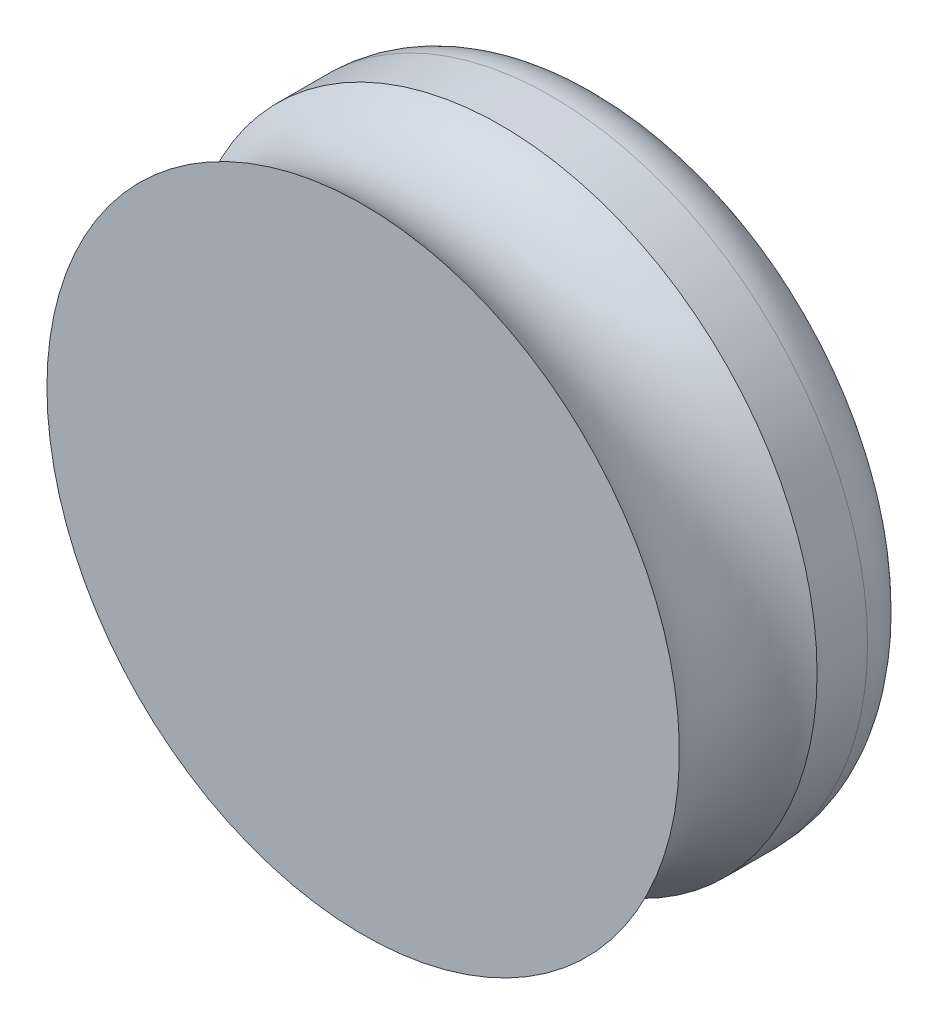
ISO-10303-21;
HEADER;
FILE_DESCRIPTION(('STEP AP214'),'2;1');
FILE_NAME('part.step','',(''),(''),'','','');
FILE_SCHEMA(('AUTOMOTIVE_DESIGN { 1 0 10303 214 1 1 1 1 }'));
ENDSEC;
DATA;
#1=APPLICATION_CONTEXT('core data for automotive mechanical design processes');
#2=APPLICATION_PROTOCOL_DEFINITION('international standard','automotive_design',2000,#1);
#3=PRODUCT_CONTEXT('',#1,'mechanical');
#4=PRODUCT('Part','Part','',(#3));
#5=PRODUCT_RELATED_PRODUCT_CATEGORY('part','',(#4));
#6=PRODUCT_DEFINITION_FORMATION('','',#4);
#7=PRODUCT_DEFINITION_CONTEXT('part definition',#1,'design');
#8=PRODUCT_DEFINITION('design','',#6,#7);
#9=PRODUCT_DEFINITION_SHAPE('','',#8);
#10=(LENGTH_UNIT() NAMED_UNIT(*) SI_UNIT(.MILLI.,.METRE.));
#11=(NAMED_UNIT(*) PLANE_ANGLE_UNIT() SI_UNIT($,.RADIAN.));
#12=(NAMED_UNIT(*) SI_UNIT($,.STERADIAN.) SOLID_ANGLE_UNIT());
#13=UNCERTAINTY_MEASURE_WITH_UNIT(LENGTH_MEASURE(1.E-05),#10,'distance_accuracy_value','');
#14=(GEOMETRIC_REPRESENTATION_CONTEXT(3) GLOBAL_UNCERTAINTY_ASSIGNED_CONTEXT((#13)) GLOBAL_UNIT_ASSIGNED_CONTEXT((#10,
#11,#12)) REPRESENTATION_CONTEXT('',''));
#15=CARTESIAN_POINT('',(0.,0.,0.));
#16=DIRECTION('',(0.,0.,1.));
#17=DIRECTION('',(1.,0.,0.));
#18=AXIS2_PLACEMENT_3D('',#15,#16,#17);
#19=CARTESIAN_POINT('',(-173.270710986926,-62.9180736437963,-8.00000000000006));
#20=DIRECTION('',(0.,0.,-1.));
#21=DIRECTION('',(-1.,0.,0.));
#22=AXIS2_PLACEMENT_3D('',#19,#20,#21);
#23=PLANE('',#22);
#24=CARTESIAN_POINT('',(-175.270710986926,-62.9180736437963,-8.00000000000006));
#25=DIRECTION('',(0.,0.,-1.));
#26=DIRECTION('',(-1.,0.,0.));
#27=AXIS2_PLACEMENT_3D('',#24,#25,#26);
#28=CIRCLE('',#27,4.);
#29=CARTESIAN_POINT('',(-179.270710986926,-62.9180736437963,-8.00000000000006));
#30=VERTEX_POINT('',#29);
#31=EDGE_CURVE('E23',#30,#30,#28,.F.);
#32=ORIENTED_EDGE('',*,*,#31,.F.);
#33=EDGE_LOOP('',(#32));
#34=FACE_BOUND('',#33,.T.);
#35=ADVANCED_FACE('F19',(#34),#23,.T.);
#36=CARTESIAN_POINT('',(-175.270710986926,-62.9180736437963,-8.00000000000006));
#37=DIRECTION('',(0.,0.,-1.));
#38=DIRECTION('',(-1.,0.,0.));
#39=AXIS2_PLACEMENT_3D('',#36,#37,#38);
#40=CYLINDRICAL_SURFACE('',#39,4.);
#41=ORIENTED_EDGE('',*,*,#31,.T.);
#42=EDGE_LOOP('',(#41));
#43=FACE_BOUND('',#42,.T.);
#44=CARTESIAN_POINT('',(-175.270710986926,-62.9180736437963,-7.88000000000006));
#45=DIRECTION('',(0.,0.,1.));
#46=DIRECTION('',(1.,0.,0.));
#47=AXIS2_PLACEMENT_3D('',#44,#45,#46);
#48=CIRCLE('',#47,3.99999999999998);
#49=CARTESIAN_POINT('',(-171.270710986926,-62.9180736437963,-7.88000000000006));
#50=VERTEX_POINT('',#49);
#51=EDGE_CURVE('E34',#50,#50,#48,.T.);
#52=ORIENTED_EDGE('',*,*,#51,.F.);
#53=EDGE_LOOP('',(#52));
#54=FACE_BOUND('',#53,.T.);
#55=ADVANCED_FACE('F45',(#43,#54),#40,.T.);
#56=CARTESIAN_POINT('',(-175.270710986926,-62.9180736437963,-7.00000000000006));
#57=DIRECTION('',(0.,0.,-1.));
#58=DIRECTION('',(-1.,0.,0.));
#59=AXIS2_PLACEMENT_3D('',#56,#57,#58);
#60=TOROIDAL_SURFACE('',#59,4.00000000000001,0.880000000000002);
#61=ORIENTED_EDGE('',*,*,#51,.T.);
#62=EDGE_LOOP('',(#61));
#63=FACE_BOUND('',#62,.T.);
#64=CARTESIAN_POINT('',(-175.270710986926,-62.9180736437963,-7.00000000000006));
#65=DIRECTION('',(0.,0.,1.));
#66=DIRECTION('',(1.,0.,0.));
#67=AXIS2_PLACEMENT_3D('',#64,#65,#66);
#68=CIRCLE('',#67,4.88);
#69=CARTESIAN_POINT('',(-170.390710986926,-62.9180736437963,-7.00000000000006));
#70=VERTEX_POINT('',#69);
#71=EDGE_CURVE('E31',#70,#70,#68,.T.);
#72=ORIENTED_EDGE('',*,*,#71,.F.);
#73=EDGE_LOOP('',(#72));
#74=FACE_BOUND('',#73,.T.);
#75=ADVANCED_FACE('F43',(#63,#74),#60,.T.);
#76=CARTESIAN_POINT('',(-175.270710986926,-62.9180736437963,-6.58570381824799));
#77=DIRECTION('',(0.,0.,1.));
#78=DIRECTION('',(1.,0.,0.));
#79=AXIS2_PLACEMENT_3D('',#76,#77,#78);
#80=CYLINDRICAL_SURFACE('',#79,4.88);
#81=ORIENTED_EDGE('',*,*,#71,.T.);
#82=EDGE_LOOP('',(#81));
#83=FACE_BOUND('',#82,.T.);
#84=CARTESIAN_POINT('',(-175.270710986926,-62.9180736437963,-6.22092476440517));
#85=DIRECTION('',(0.,0.,-1.));
#86=DIRECTION('',(-1.,0.,0.));
#87=AXIS2_PLACEMENT_3D('',#84,#85,#86);
#88=CIRCLE('',#87,4.88000000000001);
#89=CARTESIAN_POINT('',(-180.150710986926,-62.9180736437963,-6.22092476440517));
#90=VERTEX_POINT('',#89);
#91=EDGE_CURVE('E27',#90,#90,#88,.T.);
#92=ORIENTED_EDGE('',*,*,#91,.T.);
#93=EDGE_LOOP('',(#92));
#94=FACE_BOUND('',#93,.T.);
#95=ADVANCED_FACE('F40',(#83,#94),#80,.T.);
#96=CARTESIAN_POINT('',(-175.270710986926,-62.9180736437963,-5.15888099341062));
#97=DIRECTION('',(0.,0.,-1.));
#98=DIRECTION('',(-1.,0.,0.));
#99=AXIS2_PLACEMENT_3D('',#96,#97,#98);
#100=TOROIDAL_SURFACE('',#99,5.98358245611307,1.53161065840795);
#101=ORIENTED_EDGE('',*,*,#91,.F.);
#102=EDGE_LOOP('',(#101));
#103=FACE_BOUND('',#102,.T.);
#104=CARTESIAN_POINT('',(-175.270710986926,-62.9180736437963,-4.0968372224165));
#105=DIRECTION('',(0.,0.,-1.));
#106=DIRECTION('',(-1.,0.,0.));
#107=AXIS2_PLACEMENT_3D('',#104,#105,#106);
#108=CIRCLE('',#107,4.8799999999996);
#109=CARTESIAN_POINT('',(-180.150710986926,-62.9180736437963,-4.0968372224165));
#110=VERTEX_POINT('',#109);
#111=EDGE_CURVE('E11',#110,#110,#108,.F.);
#112=ORIENTED_EDGE('',*,*,#111,.F.);
#113=EDGE_LOOP('',(#112));
#114=FACE_BOUND('',#113,.T.);
#115=ADVANCED_FACE('F21',(#103,#114),#100,.F.);
#116=CARTESIAN_POINT('',(-175.270710986926,-62.9180736437963,-4.0968372224165));
#117=DIRECTION('',(0.,0.,1.));
#118=DIRECTION('',(1.,0.,0.));
#119=AXIS2_PLACEMENT_3D('',#116,#117,#118);
#120=PLANE('',#119);
#121=ORIENTED_EDGE('',*,*,#111,.T.);
#122=EDGE_LOOP('',(#121));
#123=FACE_BOUND('',#122,.T.);
#124=ADVANCED_FACE('F56',(#123),#120,.T.);
#125=CLOSED_SHELL('',(#35,#55,#75,#95,#115,#124));
#126=MANIFOLD_SOLID_BREP('B1',#125);
#127=ADVANCED_BREP_SHAPE_REPRESENTATION('',(#18,#126),#14);
#128=SHAPE_DEFINITION_REPRESENTATION(#9,#127);
ENDSEC;
END-ISO-10303-21;
